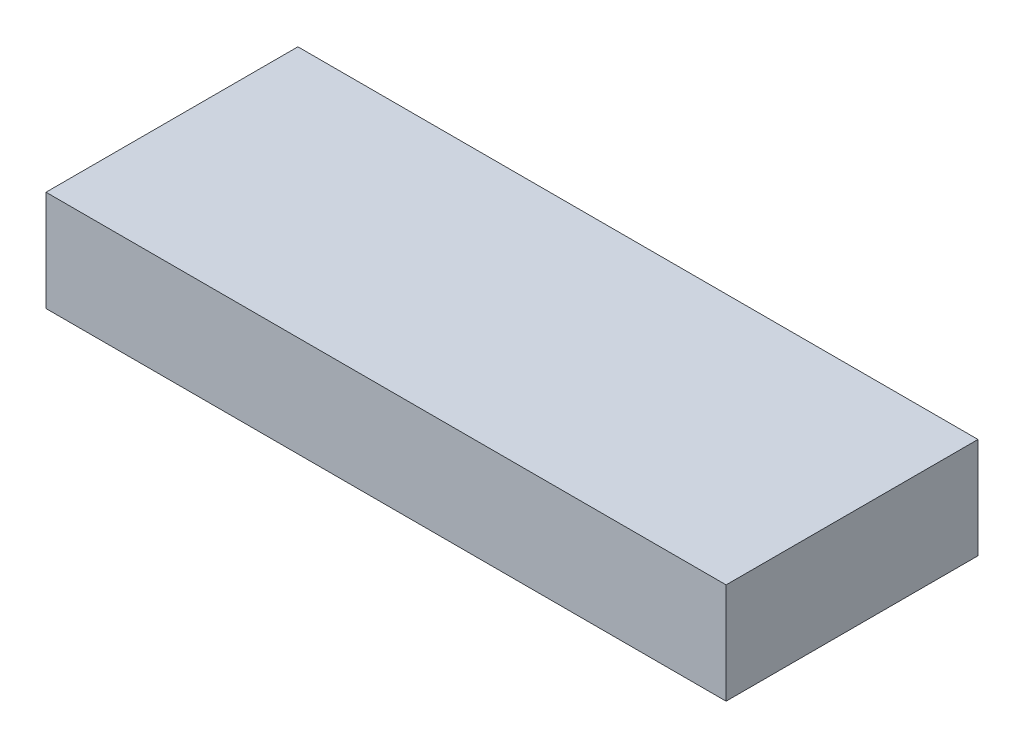
ISO-10303-21;
HEADER;
FILE_DESCRIPTION(('STEP AP214'),'2;1');
FILE_NAME('part.step','',(''),(''),'','','');
FILE_SCHEMA(('AUTOMOTIVE_DESIGN { 1 0 10303 214 1 1 1 1 }'));
ENDSEC;
DATA;
#1=APPLICATION_CONTEXT('core data for automotive mechanical design processes');
#2=APPLICATION_PROTOCOL_DEFINITION('international standard','automotive_design',2000,#1);
#3=PRODUCT_CONTEXT('',#1,'mechanical');
#4=PRODUCT('Part','Part','',(#3));
#5=PRODUCT_RELATED_PRODUCT_CATEGORY('part','',(#4));
#6=PRODUCT_DEFINITION_FORMATION('','',#4);
#7=PRODUCT_DEFINITION_CONTEXT('part definition',#1,'design');
#8=PRODUCT_DEFINITION('design','',#6,#7);
#9=PRODUCT_DEFINITION_SHAPE('','',#8);
#10=(LENGTH_UNIT() NAMED_UNIT(*) SI_UNIT(.MILLI.,.METRE.));
#11=(NAMED_UNIT(*) PLANE_ANGLE_UNIT() SI_UNIT($,.RADIAN.));
#12=(NAMED_UNIT(*) SI_UNIT($,.STERADIAN.) SOLID_ANGLE_UNIT());
#13=UNCERTAINTY_MEASURE_WITH_UNIT(LENGTH_MEASURE(1.E-05),#10,'distance_accuracy_value','');
#14=(GEOMETRIC_REPRESENTATION_CONTEXT(3) GLOBAL_UNCERTAINTY_ASSIGNED_CONTEXT((#13)) GLOBAL_UNIT_ASSIGNED_CONTEXT((#10,
#11,#12)) REPRESENTATION_CONTEXT('',''));
#15=CARTESIAN_POINT('',(0.,0.,0.));
#16=DIRECTION('',(0.,0.,1.));
#17=DIRECTION('',(1.,0.,0.));
#18=AXIS2_PLACEMENT_3D('',#15,#16,#17);
#19=CARTESIAN_POINT('',(0.,10.16,0.));
#20=DIRECTION('',(1.,0.,0.));
#21=DIRECTION('',(0.,0.,-1.));
#22=AXIS2_PLACEMENT_3D('',#19,#20,#21);
#23=PLANE('',#22);
#24=CARTESIAN_POINT('',(0.,2.01643381512258,-12.8025461484478));
#25=DIRECTION('',(-1.,0.,0.));
#26=DIRECTION('',(0.,0.,1.));
#27=AXIS2_PLACEMENT_3D('',#24,#25,#26);
#28=CIRCLE('',#27,1.12625833081403);
#29=CARTESIAN_POINT('',(0.,2.01643381512258,-11.6762878176338));
#30=VERTEX_POINT('',#29);
#31=EDGE_CURVE('E127',#30,#30,#28,.T.);
#32=ORIENTED_EDGE('',*,*,#31,.F.);
#33=EDGE_LOOP('',(#32));
#34=FACE_BOUND('',#33,.T.);
#35=DIRECTION('',(0.,0.,1.));
#36=VECTOR('',#35,1.);
#37=CARTESIAN_POINT('',(0.,0.,0.));
#38=LINE('',#37,#36);
#39=CARTESIAN_POINT('',(0.,0.,-25.4));
#40=VERTEX_POINT('',#39);
#41=CARTESIAN_POINT('',(0.,0.,0.));
#42=VERTEX_POINT('',#41);
#43=EDGE_CURVE('E106',#40,#42,#38,.T.);
#44=ORIENTED_EDGE('',*,*,#43,.T.);
#45=DIRECTION('',(0.,-1.,0.));
#46=VECTOR('',#45,1.);
#47=CARTESIAN_POINT('',(0.,10.16,0.));
#48=LINE('',#47,#46);
#49=CARTESIAN_POINT('',(0.,10.16,0.));
#50=VERTEX_POINT('',#49);
#51=EDGE_CURVE('E11',#50,#42,#48,.T.);
#52=ORIENTED_EDGE('',*,*,#51,.F.);
#53=DIRECTION('',(0.,0.,1.));
#54=VECTOR('',#53,1.);
#55=CARTESIAN_POINT('',(0.,10.16,0.));
#56=LINE('',#55,#54);
#57=CARTESIAN_POINT('',(0.,10.16,-25.4));
#58=VERTEX_POINT('',#57);
#59=EDGE_CURVE('E90',#58,#50,#56,.T.);
#60=ORIENTED_EDGE('',*,*,#59,.F.);
#61=DIRECTION('',(0.,-1.,0.));
#62=VECTOR('',#61,1.);
#63=CARTESIAN_POINT('',(0.,10.16,-25.4));
#64=LINE('',#63,#62);
#65=EDGE_CURVE('E102',#58,#40,#64,.T.);
#66=ORIENTED_EDGE('',*,*,#65,.T.);
#67=EDGE_LOOP('',(#44,#52,#60,#66));
#68=FACE_BOUND('',#67,.T.);
#69=ADVANCED_FACE('F38',(#34,#68),#23,.F.);
#70=CARTESIAN_POINT('',(0.,10.16,0.));
#71=DIRECTION('',(0.,0.,-1.));
#72=DIRECTION('',(-1.,0.,0.));
#73=AXIS2_PLACEMENT_3D('',#70,#71,#72);
#74=PLANE('',#73);
#75=DIRECTION('',(1.,0.,0.));
#76=VECTOR('',#75,1.);
#77=CARTESIAN_POINT('',(0.,0.,0.));
#78=LINE('',#77,#76);
#79=CARTESIAN_POINT('',(68.58,0.,0.));
#80=VERTEX_POINT('',#79);
#81=EDGE_CURVE('E95',#42,#80,#78,.T.);
#82=ORIENTED_EDGE('',*,*,#81,.T.);
#83=DIRECTION('',(0.,-1.,0.));
#84=VECTOR('',#83,1.);
#85=CARTESIAN_POINT('',(68.58,10.16,0.));
#86=LINE('',#85,#84);
#87=CARTESIAN_POINT('',(68.58,10.16,0.));
#88=VERTEX_POINT('',#87);
#89=EDGE_CURVE('E47',#88,#80,#86,.T.);
#90=ORIENTED_EDGE('',*,*,#89,.F.);
#91=DIRECTION('',(1.,0.,0.));
#92=VECTOR('',#91,1.);
#93=CARTESIAN_POINT('',(0.,10.16,0.));
#94=LINE('',#93,#92);
#95=EDGE_CURVE('E85',#50,#88,#94,.T.);
#96=ORIENTED_EDGE('',*,*,#95,.F.);
#97=ORIENTED_EDGE('',*,*,#51,.T.);
#98=EDGE_LOOP('',(#82,#90,#96,#97));
#99=FACE_BOUND('',#98,.T.);
#100=ADVANCED_FACE('F94',(#99),#74,.F.);
#101=CARTESIAN_POINT('',(68.58,10.16,0.));
#102=DIRECTION('',(-1.,0.,0.));
#103=DIRECTION('',(0.,0.,1.));
#104=AXIS2_PLACEMENT_3D('',#101,#102,#103);
#105=PLANE('',#104);
#106=DIRECTION('',(0.,0.,-1.));
#107=VECTOR('',#106,1.);
#108=CARTESIAN_POINT('',(68.58,0.,0.));
#109=LINE('',#108,#107);
#110=CARTESIAN_POINT('',(68.58,0.,-25.4));
#111=VERTEX_POINT('',#110);
#112=EDGE_CURVE('E72',#80,#111,#109,.T.);
#113=ORIENTED_EDGE('',*,*,#112,.T.);
#114=DIRECTION('',(0.,-1.,0.));
#115=VECTOR('',#114,1.);
#116=CARTESIAN_POINT('',(68.58,10.16,-25.4));
#117=LINE('',#116,#115);
#118=CARTESIAN_POINT('',(68.58,10.16,-25.4));
#119=VERTEX_POINT('',#118);
#120=EDGE_CURVE('E97',#119,#111,#117,.T.);
#121=ORIENTED_EDGE('',*,*,#120,.F.);
#122=DIRECTION('',(0.,0.,-1.));
#123=VECTOR('',#122,1.);
#124=CARTESIAN_POINT('',(68.58,10.16,0.));
#125=LINE('',#124,#123);
#126=EDGE_CURVE('E88',#88,#119,#125,.T.);
#127=ORIENTED_EDGE('',*,*,#126,.F.);
#128=ORIENTED_EDGE('',*,*,#89,.T.);
#129=EDGE_LOOP('',(#113,#121,#127,#128));
#130=FACE_BOUND('',#129,.T.);
#131=ADVANCED_FACE('F98',(#130),#105,.F.);
#132=CARTESIAN_POINT('',(0.,10.16,-25.4));
#133=DIRECTION('',(0.,0.,1.));
#134=DIRECTION('',(1.,0.,0.));
#135=AXIS2_PLACEMENT_3D('',#132,#133,#134);
#136=PLANE('',#135);
#137=DIRECTION('',(-1.,0.,0.));
#138=VECTOR('',#137,1.);
#139=CARTESIAN_POINT('',(0.,0.,-25.4));
#140=LINE('',#139,#138);
#141=EDGE_CURVE('E78',#111,#40,#140,.T.);
#142=ORIENTED_EDGE('',*,*,#141,.T.);
#143=ORIENTED_EDGE('',*,*,#65,.F.);
#144=DIRECTION('',(-1.,0.,0.));
#145=VECTOR('',#144,1.);
#146=CARTESIAN_POINT('',(0.,10.16,-25.4));
#147=LINE('',#146,#145);
#148=EDGE_CURVE('E55',#119,#58,#147,.T.);
#149=ORIENTED_EDGE('',*,*,#148,.F.);
#150=ORIENTED_EDGE('',*,*,#120,.T.);
#151=EDGE_LOOP('',(#142,#143,#149,#150));
#152=FACE_BOUND('',#151,.T.);
#153=ADVANCED_FACE('F120',(#152),#136,.F.);
#154=CARTESIAN_POINT('',(0.,10.16,0.));
#155=DIRECTION('',(0.,-1.,0.));
#156=DIRECTION('',(0.,0.,-1.));
#157=AXIS2_PLACEMENT_3D('',#154,#155,#156);
#158=PLANE('',#157);
#159=ORIENTED_EDGE('',*,*,#59,.T.);
#160=ORIENTED_EDGE('',*,*,#95,.T.);
#161=ORIENTED_EDGE('',*,*,#126,.T.);
#162=ORIENTED_EDGE('',*,*,#148,.T.);
#163=EDGE_LOOP('',(#159,#160,#161,#162));
#164=FACE_BOUND('',#163,.T.);
#165=ADVANCED_FACE('F86',(#164),#158,.F.);
#166=CARTESIAN_POINT('',(0.,0.,0.));
#167=DIRECTION('',(0.,-1.,0.));
#168=DIRECTION('',(0.,0.,-1.));
#169=AXIS2_PLACEMENT_3D('',#166,#167,#168);
#170=PLANE('',#169);
#171=ORIENTED_EDGE('',*,*,#43,.F.);
#172=ORIENTED_EDGE('',*,*,#141,.F.);
#173=ORIENTED_EDGE('',*,*,#112,.F.);
#174=ORIENTED_EDGE('',*,*,#81,.F.);
#175=EDGE_LOOP('',(#171,#172,#173,#174));
#176=FACE_BOUND('',#175,.T.);
#177=ADVANCED_FACE('F123',(#176),#170,.T.);
#178=CARTESIAN_POINT('',(5.08,2.01643381512258,-12.8025461484478));
#179=DIRECTION('',(-1.,0.,0.));
#180=DIRECTION('',(0.,0.,1.));
#181=AXIS2_PLACEMENT_3D('',#178,#179,#180);
#182=CYLINDRICAL_SURFACE('',#181,1.12625833081403);
#183=CARTESIAN_POINT('',(5.08,2.01643381512258,-12.8025461484478));
#184=DIRECTION('',(-1.,0.,0.));
#185=DIRECTION('',(0.,0.,1.));
#186=AXIS2_PLACEMENT_3D('',#183,#184,#185);
#187=CIRCLE('',#186,1.12625833081403);
#188=CARTESIAN_POINT('',(5.08,2.01643381512258,-11.6762878176338));
#189=VERTEX_POINT('',#188);
#190=EDGE_CURVE('E110',#189,#189,#187,.T.);
#191=ORIENTED_EDGE('',*,*,#190,.F.);
#192=EDGE_LOOP('',(#191));
#193=FACE_BOUND('',#192,.T.);
#194=ORIENTED_EDGE('',*,*,#31,.T.);
#195=EDGE_LOOP('',(#194));
#196=FACE_BOUND('',#195,.T.);
#197=ADVANCED_FACE('F137',(#193,#196),#182,.F.);
#198=CARTESIAN_POINT('',(5.08,2.01643381512258,-12.8025461484478));
#199=DIRECTION('',(-1.,0.,0.));
#200=DIRECTION('',(0.,0.,1.));
#201=AXIS2_PLACEMENT_3D('',#198,#199,#200);
#202=PLANE('',#201);
#203=ORIENTED_EDGE('',*,*,#190,.T.);
#204=EDGE_LOOP('',(#203));
#205=FACE_BOUND('',#204,.T.);
#206=ADVANCED_FACE('F135',(#205),#202,.T.);
#207=CLOSED_SHELL('',(#69,#100,#131,#153,#165,#177,#197,#206));
#208=MANIFOLD_SOLID_BREP('B2',#207);
#209=ADVANCED_BREP_SHAPE_REPRESENTATION('',(#18,#208),#14);
#210=SHAPE_DEFINITION_REPRESENTATION(#9,#209);
ENDSEC;
END-ISO-10303-21;
